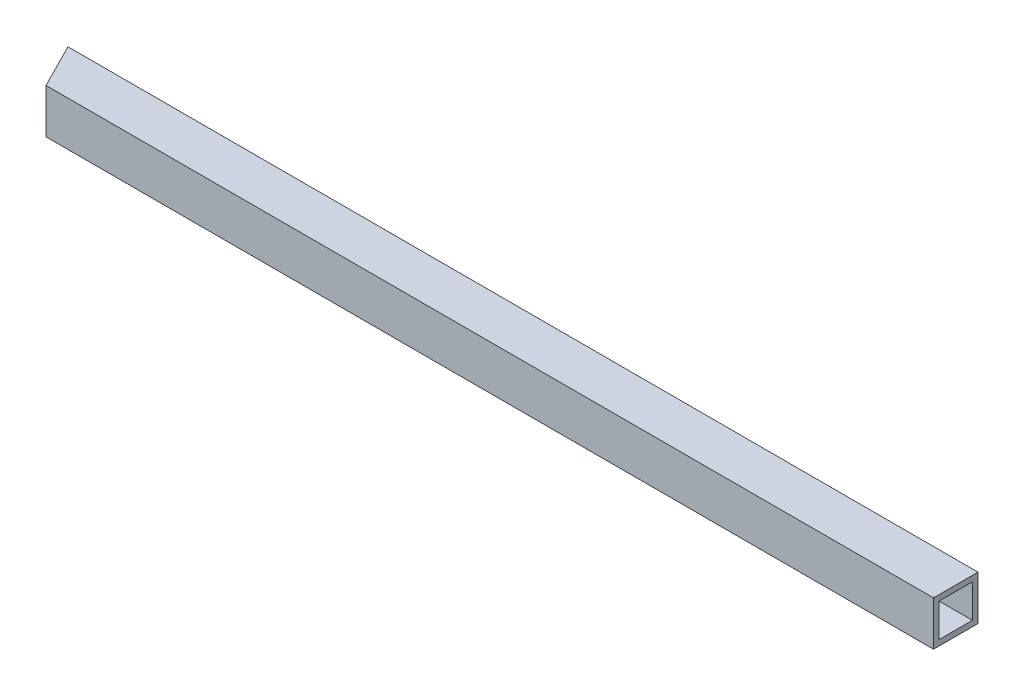
ISO-10303-21;
HEADER;
FILE_DESCRIPTION(('STEP AP214'),'2;1');
FILE_NAME('part.step','',(''),(''),'','','');
FILE_SCHEMA(('AUTOMOTIVE_DESIGN { 1 0 10303 214 1 1 1 1 }'));
ENDSEC;
DATA;
#1=APPLICATION_CONTEXT('core data for automotive mechanical design processes');
#2=APPLICATION_PROTOCOL_DEFINITION('international standard','automotive_design',2000,#1);
#3=PRODUCT_CONTEXT('',#1,'mechanical');
#4=PRODUCT('Part','Part','',(#3));
#5=PRODUCT_RELATED_PRODUCT_CATEGORY('part','',(#4));
#6=PRODUCT_DEFINITION_FORMATION('','',#4);
#7=PRODUCT_DEFINITION_CONTEXT('part definition',#1,'design');
#8=PRODUCT_DEFINITION('design','',#6,#7);
#9=PRODUCT_DEFINITION_SHAPE('','',#8);
#10=(LENGTH_UNIT() NAMED_UNIT(*) SI_UNIT(.MILLI.,.METRE.));
#11=(NAMED_UNIT(*) PLANE_ANGLE_UNIT() SI_UNIT($,.RADIAN.));
#12=(NAMED_UNIT(*) SI_UNIT($,.STERADIAN.) SOLID_ANGLE_UNIT());
#13=UNCERTAINTY_MEASURE_WITH_UNIT(LENGTH_MEASURE(1.E-05),#10,'distance_accuracy_value','');
#14=(GEOMETRIC_REPRESENTATION_CONTEXT(3) GLOBAL_UNCERTAINTY_ASSIGNED_CONTEXT((#13)) GLOBAL_UNIT_ASSIGNED_CONTEXT((#10,
#11,#12)) REPRESENTATION_CONTEXT('',''));
#15=CARTESIAN_POINT('',(0.,0.,0.));
#16=DIRECTION('',(0.,0.,1.));
#17=DIRECTION('',(1.,0.,0.));
#18=AXIS2_PLACEMENT_3D('',#15,#16,#17);
#19=CARTESIAN_POINT('',(0.,0.,203.2));
#20=DIRECTION('',(0.,1.,0.));
#21=DIRECTION('',(0.,0.,1.));
#22=AXIS2_PLACEMENT_3D('',#19,#20,#21);
#23=PLANE('',#22);
#24=DIRECTION('',(1.,0.,0.));
#25=VECTOR('',#24,1.);
#26=CARTESIAN_POINT('',(0.,0.,203.2));
#27=LINE('',#26,#25);
#28=CARTESIAN_POINT('',(102.8663764432,0.,203.2));
#29=VERTEX_POINT('',#28);
#30=CARTESIAN_POINT('',(4155.694,0.,203.2));
#31=VERTEX_POINT('',#30);
#32=EDGE_CURVE('E112',#29,#31,#27,.T.);
#33=ORIENTED_EDGE('',*,*,#32,.F.);
#34=DIRECTION('',(-0.45165629697856,0.,-0.892192013750188));
#35=VECTOR('',#34,1.);
#36=CARTESIAN_POINT('',(0.,0.,0.));
#37=LINE('',#36,#35);
#38=CARTESIAN_POINT('',(0.,0.,0.));
#39=VERTEX_POINT('',#38);
#40=EDGE_CURVE('E98',#29,#39,#37,.T.);
#41=ORIENTED_EDGE('',*,*,#40,.T.);
#42=DIRECTION('',(1.,0.,0.));
#43=VECTOR('',#42,1.);
#44=CARTESIAN_POINT('',(0.,0.,0.));
#45=LINE('',#44,#43);
#46=CARTESIAN_POINT('',(4155.694,0.,0.));
#47=VERTEX_POINT('',#46);
#48=EDGE_CURVE('E132',#39,#47,#45,.T.);
#49=ORIENTED_EDGE('',*,*,#48,.T.);
#50=DIRECTION('',(0.,0.,-1.));
#51=VECTOR('',#50,1.);
#52=CARTESIAN_POINT('',(4155.694,0.,203.2));
#53=LINE('',#52,#51);
#54=EDGE_CURVE('E41',#31,#47,#53,.T.);
#55=ORIENTED_EDGE('',*,*,#54,.F.);
#56=EDGE_LOOP('',(#33,#41,#49,#55));
#57=FACE_BOUND('',#56,.T.);
#58=ADVANCED_FACE('F33',(#57),#23,.F.);
#59=CARTESIAN_POINT('',(4155.694,0.,203.2));
#60=DIRECTION('',(-1.,0.,0.));
#61=DIRECTION('',(0.,0.,1.));
#62=AXIS2_PLACEMENT_3D('',#59,#60,#61);
#63=PLANE('',#62);
#64=DIRECTION('',(0.,0.,-1.));
#65=VECTOR('',#64,1.);
#66=CARTESIAN_POINT('',(4155.694,177.8,177.8));
#67=LINE('',#66,#65);
#68=CARTESIAN_POINT('',(4155.694,177.8,177.8));
#69=VERTEX_POINT('',#68);
#70=CARTESIAN_POINT('',(4155.694,177.8,25.4));
#71=VERTEX_POINT('',#70);
#72=EDGE_CURVE('E150',#69,#71,#67,.T.);
#73=ORIENTED_EDGE('',*,*,#72,.T.);
#74=DIRECTION('',(0.,-1.,0.));
#75=VECTOR('',#74,1.);
#76=CARTESIAN_POINT('',(4155.694,177.8,25.4));
#77=LINE('',#76,#75);
#78=CARTESIAN_POINT('',(4155.694,25.4,25.4));
#79=VERTEX_POINT('',#78);
#80=EDGE_CURVE('E161',#71,#79,#77,.T.);
#81=ORIENTED_EDGE('',*,*,#80,.T.);
#82=DIRECTION('',(0.,0.,1.));
#83=VECTOR('',#82,1.);
#84=CARTESIAN_POINT('',(4155.694,25.4,25.4));
#85=LINE('',#84,#83);
#86=CARTESIAN_POINT('',(4155.694,25.4,177.8));
#87=VERTEX_POINT('',#86);
#88=EDGE_CURVE('E159',#79,#87,#85,.T.);
#89=ORIENTED_EDGE('',*,*,#88,.T.);
#90=DIRECTION('',(0.,1.,0.));
#91=VECTOR('',#90,1.);
#92=CARTESIAN_POINT('',(4155.694,25.4,177.8));
#93=LINE('',#92,#91);
#94=EDGE_CURVE('E56',#87,#69,#93,.T.);
#95=ORIENTED_EDGE('',*,*,#94,.T.);
#96=EDGE_LOOP('',(#73,#81,#89,#95));
#97=FACE_BOUND('',#96,.T.);
#98=DIRECTION('',(0.,1.,0.));
#99=VECTOR('',#98,1.);
#100=CARTESIAN_POINT('',(4155.694,0.,0.));
#101=LINE('',#100,#99);
#102=CARTESIAN_POINT('',(4155.694,203.2,0.));
#103=VERTEX_POINT('',#102);
#104=EDGE_CURVE('E124',#47,#103,#101,.T.);
#105=ORIENTED_EDGE('',*,*,#104,.T.);
#106=DIRECTION('',(0.,0.,-1.));
#107=VECTOR('',#106,1.);
#108=CARTESIAN_POINT('',(4155.694,203.2,203.2));
#109=LINE('',#108,#107);
#110=CARTESIAN_POINT('',(4155.694,203.2,203.2));
#111=VERTEX_POINT('',#110);
#112=EDGE_CURVE('E131',#111,#103,#109,.T.);
#113=ORIENTED_EDGE('',*,*,#112,.F.);
#114=DIRECTION('',(0.,1.,0.));
#115=VECTOR('',#114,1.);
#116=CARTESIAN_POINT('',(4155.694,0.,203.2));
#117=LINE('',#116,#115);
#118=EDGE_CURVE('E119',#31,#111,#117,.T.);
#119=ORIENTED_EDGE('',*,*,#118,.F.);
#120=ORIENTED_EDGE('',*,*,#54,.T.);
#121=EDGE_LOOP('',(#105,#113,#119,#120));
#122=FACE_BOUND('',#121,.T.);
#123=ADVANCED_FACE('F178',(#97,#122),#63,.F.);
#124=CARTESIAN_POINT('',(0.,203.2,203.2));
#125=DIRECTION('',(0.,-1.,0.));
#126=DIRECTION('',(0.,0.,-1.));
#127=AXIS2_PLACEMENT_3D('',#124,#125,#126);
#128=PLANE('',#127);
#129=DIRECTION('',(-1.,0.,0.));
#130=VECTOR('',#129,1.);
#131=CARTESIAN_POINT('',(0.,203.2,0.));
#132=LINE('',#131,#130);
#133=CARTESIAN_POINT('',(0.,203.2,0.));
#134=VERTEX_POINT('',#133);
#135=EDGE_CURVE('E120',#103,#134,#132,.T.);
#136=ORIENTED_EDGE('',*,*,#135,.T.);
#137=DIRECTION('',(0.45165629697856,0.,0.892192013750188));
#138=VECTOR('',#137,1.);
#139=CARTESIAN_POINT('',(81.8823134764484,203.2,161.748538966002));
#140=LINE('',#139,#138);
#141=CARTESIAN_POINT('',(102.8663764432,203.2,203.2));
#142=VERTEX_POINT('',#141);
#143=EDGE_CURVE('E165',#134,#142,#140,.T.);
#144=ORIENTED_EDGE('',*,*,#143,.T.);
#145=DIRECTION('',(-1.,0.,0.));
#146=VECTOR('',#145,1.);
#147=CARTESIAN_POINT('',(0.,203.2,203.2));
#148=LINE('',#147,#146);
#149=EDGE_CURVE('E115',#111,#142,#148,.T.);
#150=ORIENTED_EDGE('',*,*,#149,.F.);
#151=ORIENTED_EDGE('',*,*,#112,.T.);
#152=EDGE_LOOP('',(#136,#144,#150,#151));
#153=FACE_BOUND('',#152,.T.);
#154=ADVANCED_FACE('F192',(#153),#128,.F.);
#155=CARTESIAN_POINT('',(0.,0.,203.2));
#156=DIRECTION('',(0.,0.,-1.));
#157=DIRECTION('',(-1.,0.,0.));
#158=AXIS2_PLACEMENT_3D('',#155,#156,#157);
#159=PLANE('',#158);
#160=ORIENTED_EDGE('',*,*,#149,.T.);
#161=DIRECTION('',(0.,1.,0.));
#162=VECTOR('',#161,1.);
#163=CARTESIAN_POINT('',(102.8663764432,0.,203.2));
#164=LINE('',#163,#162);
#165=EDGE_CURVE('E101',#29,#142,#164,.T.);
#166=ORIENTED_EDGE('',*,*,#165,.F.);
#167=ORIENTED_EDGE('',*,*,#32,.T.);
#168=ORIENTED_EDGE('',*,*,#118,.T.);
#169=EDGE_LOOP('',(#160,#166,#167,#168));
#170=FACE_BOUND('',#169,.T.);
#171=ADVANCED_FACE('F111',(#170),#159,.F.);
#172=CARTESIAN_POINT('',(0.,0.,0.));
#173=DIRECTION('',(0.,0.,-1.));
#174=DIRECTION('',(-1.,0.,0.));
#175=AXIS2_PLACEMENT_3D('',#172,#173,#174);
#176=PLANE('',#175);
#177=DIRECTION('',(0.,-1.,0.));
#178=VECTOR('',#177,1.);
#179=CARTESIAN_POINT('',(0.,0.,0.));
#180=LINE('',#179,#178);
#181=EDGE_CURVE('E104',#134,#39,#180,.T.);
#182=ORIENTED_EDGE('',*,*,#181,.F.);
#183=ORIENTED_EDGE('',*,*,#135,.F.);
#184=ORIENTED_EDGE('',*,*,#104,.F.);
#185=ORIENTED_EDGE('',*,*,#48,.F.);
#186=EDGE_LOOP('',(#182,#183,#184,#185));
#187=FACE_BOUND('',#186,.T.);
#188=ADVANCED_FACE('F199',(#187),#176,.T.);
#189=CARTESIAN_POINT('',(4155.694,177.8,25.4));
#190=DIRECTION('',(0.,0.,-1.));
#191=DIRECTION('',(-1.,0.,0.));
#192=AXIS2_PLACEMENT_3D('',#189,#190,#191);
#193=PLANE('',#192);
#194=DIRECTION('',(-1.,0.,0.));
#195=VECTOR('',#194,1.);
#196=CARTESIAN_POINT('',(4155.694,177.8,25.4));
#197=LINE('',#196,#195);
#198=CARTESIAN_POINT('',(12.8582970554004,177.8,25.4000000000001));
#199=VERTEX_POINT('',#198);
#200=EDGE_CURVE('E139',#71,#199,#197,.T.);
#201=ORIENTED_EDGE('',*,*,#200,.T.);
#202=DIRECTION('',(0.,-1.,0.));
#203=VECTOR('',#202,1.);
#204=CARTESIAN_POINT('',(12.8582970554003,177.8,25.4));
#205=LINE('',#204,#203);
#206=CARTESIAN_POINT('',(12.8582970554002,25.4,25.3999999999999));
#207=VERTEX_POINT('',#206);
#208=EDGE_CURVE('E169',#199,#207,#205,.T.);
#209=ORIENTED_EDGE('',*,*,#208,.T.);
#210=DIRECTION('',(-1.,0.,0.));
#211=VECTOR('',#210,1.);
#212=CARTESIAN_POINT('',(4155.694,25.4,25.4));
#213=LINE('',#212,#211);
#214=EDGE_CURVE('E127',#79,#207,#213,.T.);
#215=ORIENTED_EDGE('',*,*,#214,.F.);
#216=ORIENTED_EDGE('',*,*,#80,.F.);
#217=EDGE_LOOP('',(#201,#209,#215,#216));
#218=FACE_BOUND('',#217,.T.);
#219=ADVANCED_FACE('F177',(#218),#193,.F.);
#220=CARTESIAN_POINT('',(4155.694,177.8,177.8));
#221=DIRECTION('',(0.,1.,0.));
#222=DIRECTION('',(0.,0.,1.));
#223=AXIS2_PLACEMENT_3D('',#220,#221,#222);
#224=PLANE('',#223);
#225=DIRECTION('',(-1.,0.,0.));
#226=VECTOR('',#225,1.);
#227=CARTESIAN_POINT('',(4155.694,177.8,177.8));
#228=LINE('',#227,#226);
#229=CARTESIAN_POINT('',(90.0080793878004,177.8,177.8));
#230=VERTEX_POINT('',#229);
#231=EDGE_CURVE('E141',#69,#230,#228,.T.);
#232=ORIENTED_EDGE('',*,*,#231,.T.);
#233=DIRECTION('',(-0.45165629697856,0.,-0.892192013750188));
#234=VECTOR('',#233,1.);
#235=CARTESIAN_POINT('',(919.381216763449,177.8,1816.12563508047));
#236=LINE('',#235,#234);
#237=EDGE_CURVE('E171',#230,#199,#236,.T.);
#238=ORIENTED_EDGE('',*,*,#237,.T.);
#239=ORIENTED_EDGE('',*,*,#200,.F.);
#240=ORIENTED_EDGE('',*,*,#72,.F.);
#241=EDGE_LOOP('',(#232,#238,#239,#240));
#242=FACE_BOUND('',#241,.T.);
#243=ADVANCED_FACE('F176',(#242),#224,.F.);
#244=CARTESIAN_POINT('',(4155.694,25.4,177.8));
#245=DIRECTION('',(0.,0.,1.));
#246=DIRECTION('',(1.,0.,0.));
#247=AXIS2_PLACEMENT_3D('',#244,#245,#246);
#248=PLANE('',#247);
#249=DIRECTION('',(-1.,0.,0.));
#250=VECTOR('',#249,1.);
#251=CARTESIAN_POINT('',(4155.694,25.4,177.8));
#252=LINE('',#251,#250);
#253=CARTESIAN_POINT('',(90.0080793878003,25.4,177.8));
#254=VERTEX_POINT('',#253);
#255=EDGE_CURVE('E147',#87,#254,#252,.T.);
#256=ORIENTED_EDGE('',*,*,#255,.T.);
#257=DIRECTION('',(0.,1.,0.));
#258=VECTOR('',#257,1.);
#259=CARTESIAN_POINT('',(90.0080793878004,25.4,177.8));
#260=LINE('',#259,#258);
#261=EDGE_CURVE('E49',#254,#230,#260,.T.);
#262=ORIENTED_EDGE('',*,*,#261,.T.);
#263=ORIENTED_EDGE('',*,*,#231,.F.);
#264=ORIENTED_EDGE('',*,*,#94,.F.);
#265=EDGE_LOOP('',(#256,#262,#263,#264));
#266=FACE_BOUND('',#265,.T.);
#267=ADVANCED_FACE('F174',(#266),#248,.F.);
#268=CARTESIAN_POINT('',(4155.694,25.4,25.4));
#269=DIRECTION('',(0.,-1.,0.));
#270=DIRECTION('',(0.,0.,-1.));
#271=AXIS2_PLACEMENT_3D('',#268,#269,#270);
#272=PLANE('',#271);
#273=ORIENTED_EDGE('',*,*,#214,.T.);
#274=DIRECTION('',(0.45165629697856,0.,0.892192013750188));
#275=VECTOR('',#274,1.);
#276=CARTESIAN_POINT('',(857.969481656113,25.4,1694.81423085597));
#277=LINE('',#276,#275);
#278=EDGE_CURVE('E11',#207,#254,#277,.T.);
#279=ORIENTED_EDGE('',*,*,#278,.T.);
#280=ORIENTED_EDGE('',*,*,#255,.F.);
#281=ORIENTED_EDGE('',*,*,#88,.F.);
#282=EDGE_LOOP('',(#273,#279,#280,#281));
#283=FACE_BOUND('',#282,.T.);
#284=ADVANCED_FACE('F180',(#283),#272,.F.);
#285=CARTESIAN_POINT('',(0.,0.,0.));
#286=DIRECTION('',(0.892192013750188,0.,-0.45165629697856));
#287=DIRECTION('',(-0.45165629697856,0.,-0.892192013750188));
#288=AXIS2_PLACEMENT_3D('',#285,#286,#287);
#289=PLANE('',#288);
#290=ORIENTED_EDGE('',*,*,#237,.F.);
#291=ORIENTED_EDGE('',*,*,#261,.F.);
#292=ORIENTED_EDGE('',*,*,#278,.F.);
#293=ORIENTED_EDGE('',*,*,#208,.F.);
#294=EDGE_LOOP('',(#290,#291,#292,#293));
#295=FACE_BOUND('',#294,.T.);
#296=ORIENTED_EDGE('',*,*,#181,.T.);
#297=ORIENTED_EDGE('',*,*,#40,.F.);
#298=ORIENTED_EDGE('',*,*,#165,.T.);
#299=ORIENTED_EDGE('',*,*,#143,.F.);
#300=EDGE_LOOP('',(#296,#297,#298,#299));
#301=FACE_BOUND('',#300,.T.);
#302=ADVANCED_FACE('F100',(#295,#301),#289,.F.);
#303=CLOSED_SHELL('',(#58,#123,#154,#171,#188,#219,#243,#267,#284,#302));
#304=MANIFOLD_SOLID_BREP('B2',#303);
#305=ADVANCED_BREP_SHAPE_REPRESENTATION('',(#18,#304),#14);
#306=SHAPE_DEFINITION_REPRESENTATION(#9,#305);
ENDSEC;
END-ISO-10303-21;
